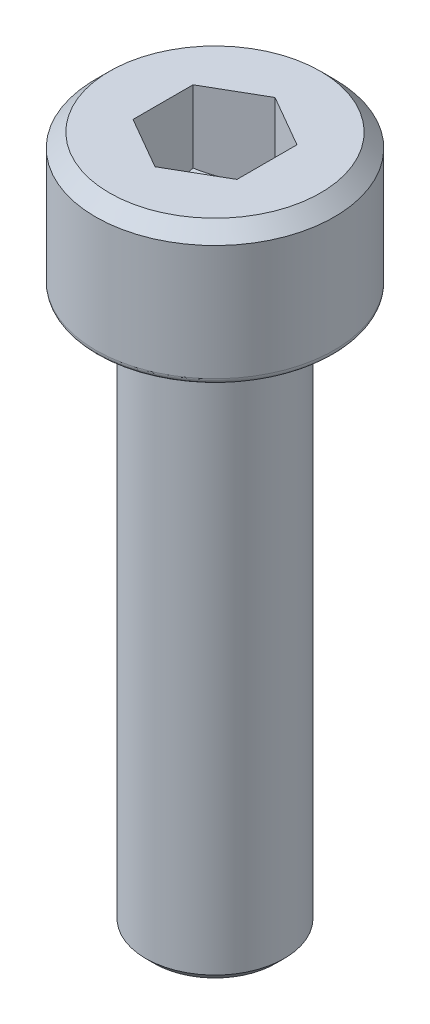
ISO-10303-21;
HEADER;
FILE_DESCRIPTION(('STEP AP214'),'2;1');
FILE_NAME('part.step','',(''),(''),'','','');
FILE_SCHEMA(('AUTOMOTIVE_DESIGN { 1 0 10303 214 1 1 1 1 }'));
ENDSEC;
DATA;
#1=APPLICATION_CONTEXT('core data for automotive mechanical design processes');
#2=APPLICATION_PROTOCOL_DEFINITION('international standard','automotive_design',2000,#1);
#3=PRODUCT_CONTEXT('',#1,'mechanical');
#4=PRODUCT('Part','Part','',(#3));
#5=PRODUCT_RELATED_PRODUCT_CATEGORY('part','',(#4));
#6=PRODUCT_DEFINITION_FORMATION('','',#4);
#7=PRODUCT_DEFINITION_CONTEXT('part definition',#1,'design');
#8=PRODUCT_DEFINITION('design','',#6,#7);
#9=PRODUCT_DEFINITION_SHAPE('','',#8);
#10=(LENGTH_UNIT() NAMED_UNIT(*) SI_UNIT(.MILLI.,.METRE.));
#11=(NAMED_UNIT(*) PLANE_ANGLE_UNIT() SI_UNIT($,.RADIAN.));
#12=(NAMED_UNIT(*) SI_UNIT($,.STERADIAN.) SOLID_ANGLE_UNIT());
#13=UNCERTAINTY_MEASURE_WITH_UNIT(LENGTH_MEASURE(1.E-05),#10,'distance_accuracy_value','');
#14=(GEOMETRIC_REPRESENTATION_CONTEXT(3) GLOBAL_UNCERTAINTY_ASSIGNED_CONTEXT((#13)) GLOBAL_UNIT_ASSIGNED_CONTEXT((#10,
#11,#12)) REPRESENTATION_CONTEXT('',''));
#15=CARTESIAN_POINT('',(0.,0.,0.));
#16=DIRECTION('',(0.,0.,1.));
#17=DIRECTION('',(1.,0.,0.));
#18=AXIS2_PLACEMENT_3D('',#15,#16,#17);
#19=CARTESIAN_POINT('',(-1.76,-16.,1.76));
#20=DIRECTION('',(0.,-1.,0.));
#21=DIRECTION('',(0.,0.,-1.));
#22=AXIS2_PLACEMENT_3D('',#19,#20,#21);
#23=PLANE('',#22);
#24=CARTESIAN_POINT('',(0.,-16.,0.));
#25=DIRECTION('',(0.,1.,0.));
#26=DIRECTION('',(0.,0.,1.));
#27=AXIS2_PLACEMENT_3D('',#24,#25,#26);
#28=CIRCLE('',#27,1.75000000000003);
#29=CARTESIAN_POINT('',(0.,-16.,1.75000000000003));
#30=VERTEX_POINT('',#29);
#31=EDGE_CURVE('E159',#30,#30,#28,.T.);
#32=ORIENTED_EDGE('',*,*,#31,.F.);
#33=EDGE_LOOP('',(#32));
#34=FACE_BOUND('',#33,.T.);
#35=ADVANCED_FACE('F16',(#34),#23,.T.);
#36=CARTESIAN_POINT('',(0.,-16.,0.));
#37=DIRECTION('',(0.,1.,0.));
#38=DIRECTION('',(0.,0.,1.));
#39=AXIS2_PLACEMENT_3D('',#36,#37,#38);
#40=CONICAL_SURFACE('',#39,1.75,0.78539816339741);
#41=CARTESIAN_POINT('',(0.,-15.75,0.));
#42=DIRECTION('',(0.,1.,0.));
#43=DIRECTION('',(0.,0.,1.));
#44=AXIS2_PLACEMENT_3D('',#41,#42,#43);
#45=CIRCLE('',#44,2.);
#46=CARTESIAN_POINT('',(0.,-15.75,2.));
#47=VERTEX_POINT('',#46);
#48=EDGE_CURVE('E155',#47,#47,#45,.T.);
#49=ORIENTED_EDGE('',*,*,#48,.F.);
#50=EDGE_LOOP('',(#49));
#51=FACE_BOUND('',#50,.T.);
#52=ORIENTED_EDGE('',*,*,#31,.T.);
#53=EDGE_LOOP('',(#52));
#54=FACE_BOUND('',#53,.T.);
#55=ADVANCED_FACE('F242',(#51,#54),#40,.T.);
#56=CARTESIAN_POINT('',(0.,-15.75,0.));
#57=DIRECTION('',(0.,1.,0.));
#58=DIRECTION('',(0.,0.,1.));
#59=AXIS2_PLACEMENT_3D('',#56,#57,#58);
#60=CYLINDRICAL_SURFACE('',#59,2.);
#61=CARTESIAN_POINT('',(0.,-0.600000000000001,0.));
#62=DIRECTION('',(0.,1.,0.));
#63=DIRECTION('',(0.,0.,1.));
#64=AXIS2_PLACEMENT_3D('',#61,#62,#63);
#65=CIRCLE('',#64,2.);
#66=CARTESIAN_POINT('',(0.,-0.600000000000001,2.));
#67=VERTEX_POINT('',#66);
#68=EDGE_CURVE('E158',#67,#67,#65,.T.);
#69=ORIENTED_EDGE('',*,*,#68,.F.);
#70=EDGE_LOOP('',(#69));
#71=FACE_BOUND('',#70,.T.);
#72=ORIENTED_EDGE('',*,*,#48,.T.);
#73=EDGE_LOOP('',(#72));
#74=FACE_BOUND('',#73,.T.);
#75=ADVANCED_FACE('F239',(#71,#74),#60,.T.);
#76=CARTESIAN_POINT('',(0.,-0.600000000000001,0.));
#77=DIRECTION('',(0.,-1.,0.));
#78=DIRECTION('',(0.,0.,-1.));
#79=AXIS2_PLACEMENT_3D('',#76,#77,#78);
#80=TOROIDAL_SURFACE('',#79,2.19999999999999,0.199999999999992);
#81=ORIENTED_EDGE('',*,*,#68,.T.);
#82=EDGE_LOOP('',(#81));
#83=FACE_BOUND('',#82,.T.);
#84=CARTESIAN_POINT('',(0.,-0.529775311682322,0.));
#85=DIRECTION('',(0.,1.,0.));
#86=DIRECTION('',(0.,0.,1.));
#87=AXIS2_PLACEMENT_3D('',#84,#85,#86);
#88=CIRCLE('',#87,2.0127341644862);
#89=CARTESIAN_POINT('',(0.,-0.529775311682322,2.0127341644862));
#90=VERTEX_POINT('',#89);
#91=EDGE_CURVE('E227',#90,#90,#88,.T.);
#92=ORIENTED_EDGE('',*,*,#91,.F.);
#93=EDGE_LOOP('',(#92));
#94=FACE_BOUND('',#93,.T.);
#95=ADVANCED_FACE('F236',(#83,#94),#80,.F.);
#96=CARTESIAN_POINT('',(0.,-0.529775311682322,0.));
#97=DIRECTION('',(0.,1.,0.));
#98=DIRECTION('',(0.,0.,1.));
#99=AXIS2_PLACEMENT_3D('',#96,#97,#98);
#100=CONICAL_SURFACE('',#99,2.0127341644862,0.358770670270564);
#101=CARTESIAN_POINT('',(0.,-0.129775311682323,0.));
#102=DIRECTION('',(0.,1.,0.));
#103=DIRECTION('',(0.,0.,1.));
#104=AXIS2_PLACEMENT_3D('',#101,#102,#103);
#105=CIRCLE('',#104,2.16273416448619);
#106=CARTESIAN_POINT('',(0.,-0.129775311682323,2.16273416448619));
#107=VERTEX_POINT('',#106);
#108=EDGE_CURVE('E218',#107,#107,#105,.T.);
#109=ORIENTED_EDGE('',*,*,#108,.F.);
#110=EDGE_LOOP('',(#109));
#111=FACE_BOUND('',#110,.T.);
#112=ORIENTED_EDGE('',*,*,#91,.T.);
#113=EDGE_LOOP('',(#112));
#114=FACE_BOUND('',#113,.T.);
#115=ADVANCED_FACE('F258',(#111,#114),#100,.T.);
#116=CARTESIAN_POINT('',(0.,-0.200000000000004,0.));
#117=DIRECTION('',(0.,-1.,0.));
#118=DIRECTION('',(0.,0.,-1.));
#119=AXIS2_PLACEMENT_3D('',#116,#117,#118);
#120=TOROIDAL_SURFACE('',#119,2.35,0.200000000000003);
#121=ORIENTED_EDGE('',*,*,#108,.T.);
#122=EDGE_LOOP('',(#121));
#123=FACE_BOUND('',#122,.T.);
#124=CARTESIAN_POINT('',(0.,0.,0.));
#125=DIRECTION('',(0.,-1.,0.));
#126=DIRECTION('',(0.,0.,-1.));
#127=AXIS2_PLACEMENT_3D('',#124,#125,#126);
#128=CIRCLE('',#127,2.35);
#129=CARTESIAN_POINT('',(0.,0.,-2.35));
#130=VERTEX_POINT('',#129);
#131=EDGE_CURVE('E215',#130,#130,#128,.F.);
#132=ORIENTED_EDGE('',*,*,#131,.F.);
#133=EDGE_LOOP('',(#132));
#134=FACE_BOUND('',#133,.T.);
#135=ADVANCED_FACE('F261',(#123,#134),#120,.F.);
#136=CARTESIAN_POINT('',(-3.27500000000001,0.,3.27500000000001));
#137=DIRECTION('',(0.,-1.,0.));
#138=DIRECTION('',(0.,0.,-1.));
#139=AXIS2_PLACEMENT_3D('',#136,#137,#138);
#140=PLANE('',#139);
#141=ORIENTED_EDGE('',*,*,#131,.T.);
#142=EDGE_LOOP('',(#141));
#143=FACE_BOUND('',#142,.T.);
#144=CARTESIAN_POINT('',(0.,0.,0.));
#145=DIRECTION('',(0.,-1.,0.));
#146=DIRECTION('',(0.,0.,-1.));
#147=AXIS2_PLACEMENT_3D('',#144,#145,#146);
#148=CIRCLE('',#147,3.26500000000209);
#149=CARTESIAN_POINT('',(0.,0.,-3.26500000000209));
#150=VERTEX_POINT('',#149);
#151=EDGE_CURVE('E212',#150,#150,#148,.F.);
#152=ORIENTED_EDGE('',*,*,#151,.F.);
#153=EDGE_LOOP('',(#152));
#154=FACE_BOUND('',#153,.T.);
#155=ADVANCED_FACE('F265',(#143,#154),#140,.T.);
#156=CARTESIAN_POINT('',(0.,0.18,0.));
#157=DIRECTION('',(0.,-1.,0.));
#158=DIRECTION('',(0.,0.,-1.));
#159=AXIS2_PLACEMENT_3D('',#156,#157,#158);
#160=TOROIDAL_SURFACE('',#159,3.265,0.179999999999994);
#161=CARTESIAN_POINT('',(0.,0.18,0.));
#162=DIRECTION('',(0.,1.,0.));
#163=DIRECTION('',(0.,0.,1.));
#164=AXIS2_PLACEMENT_3D('',#161,#162,#163);
#165=CIRCLE('',#164,3.44500000000004);
#166=CARTESIAN_POINT('',(0.,0.18,3.44500000000006));
#167=VERTEX_POINT('',#166);
#168=EDGE_CURVE('E152',#167,#167,#165,.T.);
#169=ORIENTED_EDGE('',*,*,#168,.F.);
#170=EDGE_LOOP('',(#169));
#171=FACE_BOUND('',#170,.T.);
#172=ORIENTED_EDGE('',*,*,#151,.T.);
#173=EDGE_LOOP('',(#172));
#174=FACE_BOUND('',#173,.T.);
#175=ADVANCED_FACE('F269',(#171,#174),#160,.T.);
#176=CARTESIAN_POINT('',(0.,0.18,0.));
#177=DIRECTION('',(0.,1.,0.));
#178=DIRECTION('',(0.,0.,1.));
#179=AXIS2_PLACEMENT_3D('',#176,#177,#178);
#180=CYLINDRICAL_SURFACE('',#179,3.44500000000004);
#181=CARTESIAN_POINT('',(0.,3.51000000000001,0.));
#182=DIRECTION('',(0.,1.,0.));
#183=DIRECTION('',(0.,0.,1.));
#184=AXIS2_PLACEMENT_3D('',#181,#182,#183);
#185=CIRCLE('',#184,3.44500000000004);
#186=CARTESIAN_POINT('',(0.,3.51000000000001,3.44500000000006));
#187=VERTEX_POINT('',#186);
#188=EDGE_CURVE('E130',#187,#187,#185,.T.);
#189=ORIENTED_EDGE('',*,*,#188,.F.);
#190=EDGE_LOOP('',(#189));
#191=FACE_BOUND('',#190,.T.);
#192=ORIENTED_EDGE('',*,*,#168,.T.);
#193=EDGE_LOOP('',(#192));
#194=FACE_BOUND('',#193,.T.);
#195=ADVANCED_FACE('F272',(#191,#194),#180,.T.);
#196=CARTESIAN_POINT('',(1.50866025403785,3.91999999999999,-0.861025403784438));
#197=DIRECTION('',(-0.499999999999999,0.,0.866025403784439));
#198=DIRECTION('',(-0.866025403784439,0.,-0.499999999999999));
#199=AXIS2_PLACEMENT_3D('',#196,#197,#198);
#200=PLANE('',#199);
#201=DIRECTION('',(-0.866025403784439,0.,-0.499999999999999));
#202=VECTOR('',#201,1.);
#203=CARTESIAN_POINT('',(0.750000000000001,3.91000000000001,-1.29903810567666));
#204=LINE('',#203,#202);
#205=CARTESIAN_POINT('',(1.5,3.91000000000001,-0.866025403784438));
#206=VERTEX_POINT('',#205);
#207=CARTESIAN_POINT('',(0.,3.91000000000001,-1.73205080756888));
#208=VERTEX_POINT('',#207);
#209=EDGE_CURVE('E145',#206,#208,#204,.T.);
#210=ORIENTED_EDGE('',*,*,#209,.T.);
#211=DIRECTION('',(0.,1.,0.));
#212=VECTOR('',#211,1.);
#213=CARTESIAN_POINT('',(0.,2.74373412263473,-1.73205080756888));
#214=LINE('',#213,#212);
#215=CARTESIAN_POINT('',(0.,1.82746824526945,-1.73205080756888));
#216=VERTEX_POINT('',#215);
#217=EDGE_CURVE('E142',#216,#208,#214,.T.);
#218=ORIENTED_EDGE('',*,*,#217,.F.);
#219=CARTESIAN_POINT('',(1.5,1.82746824526945,-0.866025403784438));
#220=CARTESIAN_POINT('',(1.43408408432772,1.80548990411444,-0.904081975441711));
#221=CARTESIAN_POINT('',(1.36759918340909,1.78550175309461,-0.942467050884126));
#222=CARTESIAN_POINT('',(1.23347823998543,1.75061303581965,-1.01990181367375));
#223=CARTESIAN_POINT('',(1.16583981518653,1.73572481052302,-1.05895287643895));
#224=CARTESIAN_POINT('',(1.03140117468084,1.71255021447901,-1.1365710617244));
#225=CARTESIAN_POINT('',(0.964621638287679,1.70410958596712,-1.17512624503735));
#226=CARTESIAN_POINT('',(0.830748509653507,1.69403512136728,-1.25241793189154));
#227=CARTESIAN_POINT('',(0.763655403671039,1.69239294075009,-1.29115415469129));
#228=CARTESIAN_POINT('',(0.638299132717708,1.69581796288553,-1.3635286314708));
#229=CARTESIAN_POINT('',(0.580017157017138,1.70004420918163,-1.39717774583043));
#230=CARTESIAN_POINT('',(0.46383289367647,1.71343622080806,-1.46425676154576));
#231=CARTESIAN_POINT('',(0.405931007586778,1.72260655634594,-1.49768643106623));
#232=CARTESIAN_POINT('',(0.289507393706602,1.7455306202732,-1.56490363587998));
#233=CARTESIAN_POINT('',(0.231000393462343,1.75938147693318,-1.59868266822048));
#234=CARTESIAN_POINT('',(0.114858772496332,1.79081706589896,-1.66573706434933));
#235=CARTESIAN_POINT('',(0.0572226650139546,1.80839441683361,-1.69901328651932));
#236=CARTESIAN_POINT('',(0.,1.82746824526945,-1.73205080756888));
#237=B_SPLINE_CURVE_WITH_KNOTS('',3,(#219,#220,#221,#222,#223,#224,#225,#226,#227,#228,#229,
#230,#231,#232,#233,#234,#235,#236),.UNSPECIFIED.,.F.,.F.,(4,2,2,2,2,2,2,2,4),(0.,
0.237762008667641,0.476095362770333,0.708530704614693,0.940680666673367,1.14278083697392,
1.34506814534581,1.5518412168665,1.75820848013622),.UNSPECIFIED.);
#238=CARTESIAN_POINT('',(1.5,1.82746824526945,-0.866025403784438));
#239=VERTEX_POINT('',#238);
#240=EDGE_CURVE('E188',#239,#216,#237,.T.);
#241=ORIENTED_EDGE('',*,*,#240,.F.);
#242=DIRECTION('',(0.,-1.,0.));
#243=VECTOR('',#242,1.);
#244=CARTESIAN_POINT('',(1.5,2.74373412263473,-0.866025403784438));
#245=LINE('',#244,#243);
#246=EDGE_CURVE('E71',#206,#239,#245,.T.);
#247=ORIENTED_EDGE('',*,*,#246,.F.);
#248=EDGE_LOOP('',(#210,#218,#241,#247));
#249=FACE_BOUND('',#248,.T.);
#250=ADVANCED_FACE('F199',(#249),#200,.T.);
#251=CARTESIAN_POINT('',(0.00866025403784415,3.91999999999999,-1.73705080756888));
#252=DIRECTION('',(0.5,0.,0.866025403784439));
#253=DIRECTION('',(-0.866025403784439,0.,0.5));
#254=AXIS2_PLACEMENT_3D('',#251,#252,#253);
#255=PLANE('',#254);
#256=DIRECTION('',(-0.866025403784439,0.,0.5));
#257=VECTOR('',#256,1.);
#258=CARTESIAN_POINT('',(-0.75,3.91000000000001,-1.29903810567666));
#259=LINE('',#258,#257);
#260=CARTESIAN_POINT('',(-1.5,3.91000000000001,-0.866025403784438));
#261=VERTEX_POINT('',#260);
#262=EDGE_CURVE('E139',#208,#261,#259,.T.);
#263=ORIENTED_EDGE('',*,*,#262,.T.);
#264=DIRECTION('',(0.,1.,0.));
#265=VECTOR('',#264,1.);
#266=CARTESIAN_POINT('',(-1.5,2.74373412263473,-0.866025403784438));
#267=LINE('',#266,#265);
#268=CARTESIAN_POINT('',(-1.5,1.82746824526945,-0.866025403784438));
#269=VERTEX_POINT('',#268);
#270=EDGE_CURVE('E121',#269,#261,#267,.T.);
#271=ORIENTED_EDGE('',*,*,#270,.F.);
#272=CARTESIAN_POINT('',(0.,1.82746824526945,-1.73205080756888));
#273=CARTESIAN_POINT('',(-0.0659159156722816,1.80548990411444,-1.6939942359116));
#274=CARTESIAN_POINT('',(-0.132400816590909,1.78550175309461,-1.65560916046919));
#275=CARTESIAN_POINT('',(-0.266521760014575,1.75061303581964,-1.57817439767957));
#276=CARTESIAN_POINT('',(-0.334160184813476,1.73572481052301,-1.53912333491436));
#277=CARTESIAN_POINT('',(-0.468598825319162,1.71255021447901,-1.46150514962892));
#278=CARTESIAN_POINT('',(-0.535378361712323,1.70410958596712,-1.42294996631597));
#279=CARTESIAN_POINT('',(-0.669251490346494,1.69403512136728,-1.34565827946177));
#280=CARTESIAN_POINT('',(-0.736344596328962,1.69239294075009,-1.30692205666202));
#281=CARTESIAN_POINT('',(-0.861700867282293,1.69581796288553,-1.23454757988251));
#282=CARTESIAN_POINT('',(-0.919982842982862,1.70004420918163,-1.20089846552288));
#283=CARTESIAN_POINT('',(-1.03616710632353,1.71343622080806,-1.13381944980755));
#284=CARTESIAN_POINT('',(-1.09406899241322,1.72260655634594,-1.10038978028708));
#285=CARTESIAN_POINT('',(-1.2104926062934,1.7455306202732,-1.03317257547333));
#286=CARTESIAN_POINT('',(-1.26899960653766,1.75938147693318,-0.999393543132831));
#287=CARTESIAN_POINT('',(-1.38514122750367,1.79081706589896,-0.932339147003986));
#288=CARTESIAN_POINT('',(-1.44277733498605,1.80839441683361,-0.899062924833993));
#289=CARTESIAN_POINT('',(-1.5,1.82746824526945,-0.866025403784438));
#290=B_SPLINE_CURVE_WITH_KNOTS('',3,(#272,#273,#274,#275,#276,#277,#278,#279,#280,#281,#282,
#283,#284,#285,#286,#287,#288,#289),.UNSPECIFIED.,.F.,.F.,(4,2,2,2,2,2,2,2,4),(0.,
0.237762008667641,0.476095362770333,0.708530704614692,0.940680666673366,1.14278083697392,
1.34506814534581,1.5518412168665,1.75820848013622),.UNSPECIFIED.);
#291=EDGE_CURVE('E125',#216,#269,#290,.T.);
#292=ORIENTED_EDGE('',*,*,#291,.F.);
#293=ORIENTED_EDGE('',*,*,#217,.T.);
#294=EDGE_LOOP('',(#263,#271,#292,#293));
#295=FACE_BOUND('',#294,.T.);
#296=ADVANCED_FACE('F195',(#295),#255,.T.);
#297=CARTESIAN_POINT('',(0.,3.51000000000001,0.));
#298=DIRECTION('',(0.,-1.,0.));
#299=DIRECTION('',(0.,0.,-1.));
#300=AXIS2_PLACEMENT_3D('',#297,#298,#299);
#301=CONICAL_SURFACE('',#300,3.44500000000004,0.785398163397446);
#302=CARTESIAN_POINT('',(0.,3.91000000000001,0.));
#303=DIRECTION('',(0.,-1.,0.));
#304=DIRECTION('',(0.,0.,-1.));
#305=AXIS2_PLACEMENT_3D('',#302,#303,#304);
#306=CIRCLE('',#305,3.04500000000004);
#307=CARTESIAN_POINT('',(0.,3.91000000000001,-3.04500000000001));
#308=VERTEX_POINT('',#307);
#309=EDGE_CURVE('E134',#308,#308,#306,.F.);
#310=ORIENTED_EDGE('',*,*,#309,.F.);
#311=EDGE_LOOP('',(#310));
#312=FACE_BOUND('',#311,.T.);
#313=ORIENTED_EDGE('',*,*,#188,.T.);
#314=EDGE_LOOP('',(#313));
#315=FACE_BOUND('',#314,.T.);
#316=ADVANCED_FACE('F89',(#312,#315),#301,.T.);
#317=CARTESIAN_POINT('',(1.5,3.91999999999999,0.876025403784442));
#318=DIRECTION('',(-1.,0.,0.));
#319=DIRECTION('',(0.,0.,-1.));
#320=AXIS2_PLACEMENT_3D('',#317,#318,#319);
#321=PLANE('',#320);
#322=DIRECTION('',(0.,0.,1.));
#323=VECTOR('',#322,1.);
#324=CARTESIAN_POINT('',(1.5,3.91000000000001,0.));
#325=LINE('',#324,#323);
#326=CARTESIAN_POINT('',(1.5,3.91000000000001,0.866025403784441));
#327=VERTEX_POINT('',#326);
#328=EDGE_CURVE('E118',#206,#327,#325,.T.);
#329=ORIENTED_EDGE('',*,*,#328,.F.);
#330=ORIENTED_EDGE('',*,*,#246,.T.);
#331=CARTESIAN_POINT('',(1.5,1.82746824526945,0.866025403784441));
#332=CARTESIAN_POINT('',(1.5,1.80548990411444,0.789912260469896));
#333=CARTESIAN_POINT('',(1.5,1.78550175309461,0.713142109585065));
#334=CARTESIAN_POINT('',(1.5,1.75061303581965,0.558272584005825));
#335=CARTESIAN_POINT('',(1.5,1.73572481052302,0.48017045847541));
#336=CARTESIAN_POINT('',(1.5,1.71255021447901,0.324934087904519));
#337=CARTESIAN_POINT('',(1.5,1.70410958596712,0.24782372127862));
#338=CARTESIAN_POINT('',(1.5,1.69403512136728,0.0932403475702269));
#339=CARTESIAN_POINT('',(1.5,1.69239294075009,0.0157679019707353));
#340=CARTESIAN_POINT('',(1.5,1.69581796288553,-0.128981051588291));
#341=CARTESIAN_POINT('',(1.5,1.70004420918163,-0.196279280307546));
#342=CARTESIAN_POINT('',(1.5,1.71343622080806,-0.330437311738212));
#343=CARTESIAN_POINT('',(1.5,1.72260655634594,-0.397296650779154));
#344=CARTESIAN_POINT('',(1.5,1.7455306202732,-0.53173106040665));
#345=CARTESIAN_POINT('',(1.5,1.75938147693318,-0.599289125087651));
#346=CARTESIAN_POINT('',(1.5,1.79081706589896,-0.733397917345343));
#347=CARTESIAN_POINT('',(1.5,1.80839441683361,-0.799950361685329));
#348=CARTESIAN_POINT('',(1.5,1.82746824526945,-0.866025403784439));
#349=B_SPLINE_CURVE_WITH_KNOTS('',3,(#331,#332,#333,#334,#335,#336,#337,#338,#339,#340,#341,
#342,#343,#344,#345,#346,#347,#348),.UNSPECIFIED.,.F.,.F.,(4,2,2,2,2,2,2,2,4),(0.,
0.237762008667641,0.476095362770333,0.708530704614693,0.940680666673367,1.14278083697392,
1.34506814534581,1.5518412168665,1.75820848013622),.UNSPECIFIED.);
#350=CARTESIAN_POINT('',(1.5,1.82746824526945,0.86602540378444));
#351=VERTEX_POINT('',#350);
#352=EDGE_CURVE('E129',#351,#239,#349,.T.);
#353=ORIENTED_EDGE('',*,*,#352,.F.);
#354=DIRECTION('',(0.,-1.,0.));
#355=VECTOR('',#354,1.);
#356=CARTESIAN_POINT('',(1.5,2.74373412263473,0.866025403784441));
#357=LINE('',#356,#355);
#358=EDGE_CURVE('E165',#327,#351,#357,.T.);
#359=ORIENTED_EDGE('',*,*,#358,.F.);
#360=EDGE_LOOP('',(#329,#330,#353,#359));
#361=FACE_BOUND('',#360,.T.);
#362=ADVANCED_FACE('F78',(#361),#321,.T.);
#363=CARTESIAN_POINT('',(0.,1.82746824526945,0.));
#364=DIRECTION('',(0.,1.,0.));
#365=DIRECTION('',(0.,0.,1.));
#366=AXIS2_PLACEMENT_3D('',#363,#364,#365);
#367=CONICAL_SURFACE('',#366,1.73205080756888,1.0471975511966);
#368=ORIENTED_EDGE('',*,*,#291,.T.);
#369=CARTESIAN_POINT('',(-1.5,1.82746824526945,0.866025403784439));
#370=CARTESIAN_POINT('',(-1.5,1.80694357492337,0.794933305624349));
#371=CARTESIAN_POINT('',(-1.5,1.78815266020556,0.723278805855193));
#372=CARTESIAN_POINT('',(-1.5,1.75494205000568,0.578805828585426));
#373=CARTESIAN_POINT('',(-1.5,1.74053213485961,0.505985123307448));
#374=CARTESIAN_POINT('',(-1.5,1.71735924678032,0.361160826212998));
#375=CARTESIAN_POINT('',(-1.5,1.70847272570834,0.28917762450214));
#376=CARTESIAN_POINT('',(-1.5,1.69654309825454,0.144795924098319));
#377=CARTESIAN_POINT('',(-1.5,1.69349364905317,0.0723979620362948));
#378=CARTESIAN_POINT('',(-1.5,1.6934936490546,-0.0723979620835107));
#379=CARTESIAN_POINT('',(-1.5,1.69654309825704,-0.144795924141291));
#380=CARTESIAN_POINT('',(-1.5,1.70847272571224,-0.289177624536593));
#381=CARTESIAN_POINT('',(-1.5,1.71735924678451,-0.361160826243176));
#382=CARTESIAN_POINT('',(-1.5,1.7405321348637,-0.50598512332895));
#383=CARTESIAN_POINT('',(-1.5,1.75494205000934,-0.57880582860253));
#384=CARTESIAN_POINT('',(-1.5,1.78815266020777,-0.723278805863639));
#385=CARTESIAN_POINT('',(-1.5,1.80694357492458,-0.794933305628535));
#386=CARTESIAN_POINT('',(-1.5,1.82746824526945,-0.866025403784439));
#387=B_SPLINE_CURVE_WITH_KNOTS('',3,(#369,#370,#371,#372,#373,#374,#375,#376,#377,#378,#379,
#380,#381,#382,#383,#384,#385,#386),.UNSPECIFIED.,.F.,.F.,(4,2,2,2,2,2,2,2,4),(0.,
0.222055046944474,0.444602239579074,0.661973144396534,0.879107710018951,1.09624227562884,
1.31361318043372,1.53616037305516,1.75821541998654),.UNSPECIFIED.);
#388=CARTESIAN_POINT('',(-1.5,1.82746824526945,0.866025403784439));
#389=VERTEX_POINT('',#388);
#390=EDGE_CURVE('E124',#389,#269,#387,.T.);
#391=ORIENTED_EDGE('',*,*,#390,.F.);
#392=CARTESIAN_POINT('',(0.,1.82746824526945,1.73205080756888));
#393=CARTESIAN_POINT('',(-0.0659159156722827,1.80548990411444,1.69399423591161));
#394=CARTESIAN_POINT('',(-0.13240081659091,1.78550175309461,1.65560916046919));
#395=CARTESIAN_POINT('',(-0.266521760014576,1.75061303581965,1.57817439767957));
#396=CARTESIAN_POINT('',(-0.334160184813477,1.73572481052302,1.53912333491436));
#397=CARTESIAN_POINT('',(-0.468598825319163,1.71255021447901,1.46150514962892));
#398=CARTESIAN_POINT('',(-0.535378361712324,1.70410958596712,1.42294996631597));
#399=CARTESIAN_POINT('',(-0.669251490346495,1.69403512136728,1.34565827946177));
#400=CARTESIAN_POINT('',(-0.736344596328963,1.69239294075009,1.30692205666203));
#401=CARTESIAN_POINT('',(-0.861700867282294,1.69581796288553,1.23454757988251));
#402=CARTESIAN_POINT('',(-0.919982842982863,1.70004420918163,1.20089846552288));
#403=CARTESIAN_POINT('',(-1.03616710632353,1.71343622080806,1.13381944980755));
#404=CARTESIAN_POINT('',(-1.09406899241322,1.72260655634594,1.10038978028708));
#405=CARTESIAN_POINT('',(-1.2104926062934,1.7455306202732,1.03317257547333));
#406=CARTESIAN_POINT('',(-1.26899960653766,1.75938147693318,0.999393543132832));
#407=CARTESIAN_POINT('',(-1.38514122750367,1.79081706589896,0.932339147003986));
#408=CARTESIAN_POINT('',(-1.44277733498605,1.80839441683361,0.899062924833993));
#409=CARTESIAN_POINT('',(-1.5,1.82746824526945,0.866025403784438));
#410=B_SPLINE_CURVE_WITH_KNOTS('',3,(#392,#393,#394,#395,#396,#397,#398,#399,#400,#401,#402,
#403,#404,#405,#406,#407,#408,#409),.UNSPECIFIED.,.F.,.F.,(4,2,2,2,2,2,2,2,4),(0.,
0.237762008667641,0.476095362770333,0.708530704614693,0.940680666673367,1.14278083697392,
1.34506814534581,1.5518412168665,1.75820848013622),.UNSPECIFIED.);
#411=CARTESIAN_POINT('',(0.,1.82746824526945,1.73205080756888));
#412=VERTEX_POINT('',#411);
#413=EDGE_CURVE('E107',#412,#389,#410,.T.);
#414=ORIENTED_EDGE('',*,*,#413,.F.);
#415=CARTESIAN_POINT('',(1.5,1.82746824526945,0.866025403784439));
#416=CARTESIAN_POINT('',(1.43408408432772,1.80548990411444,0.904081975441711));
#417=CARTESIAN_POINT('',(1.36759918340909,1.78550175309461,0.942467050884126));
#418=CARTESIAN_POINT('',(1.23347823998542,1.75061303581964,1.01990181367375));
#419=CARTESIAN_POINT('',(1.16583981518652,1.73572481052301,1.05895287643895));
#420=CARTESIAN_POINT('',(1.03140117468084,1.71255021447901,1.1365710617244));
#421=CARTESIAN_POINT('',(0.964621638287677,1.70410958596712,1.17512624503735));
#422=CARTESIAN_POINT('',(0.830748509653505,1.69403512136728,1.25241793189155));
#423=CARTESIAN_POINT('',(0.763655403671037,1.69239294075009,1.29115415469129));
#424=CARTESIAN_POINT('',(0.638299132717706,1.69581796288553,1.3635286314708));
#425=CARTESIAN_POINT('',(0.580017157017137,1.70004420918163,1.39717774583043));
#426=CARTESIAN_POINT('',(0.463832893676468,1.71343622080806,1.46425676154576));
#427=CARTESIAN_POINT('',(0.405931007586777,1.72260655634594,1.49768643106624));
#428=CARTESIAN_POINT('',(0.289507393706601,1.7455306202732,1.56490363587998));
#429=CARTESIAN_POINT('',(0.231000393462342,1.75938147693318,1.59868266822048));
#430=CARTESIAN_POINT('',(0.114858772496332,1.79081706589896,1.66573706434933));
#431=CARTESIAN_POINT('',(0.0572226650139537,1.80839441683361,1.69901328651932));
#432=CARTESIAN_POINT('',(0.,1.82746824526945,1.73205080756888));
#433=B_SPLINE_CURVE_WITH_KNOTS('',3,(#415,#416,#417,#418,#419,#420,#421,#422,#423,#424,#425,
#426,#427,#428,#429,#430,#431,#432),.UNSPECIFIED.,.F.,.F.,(4,2,2,2,2,2,2,2,4),(0.,
0.237762008667641,0.476095362770332,0.708530704614692,0.940680666673366,1.14278083697392,
1.34506814534581,1.5518412168665,1.75820848013622),.UNSPECIFIED.);
#434=EDGE_CURVE('E117',#351,#412,#433,.T.);
#435=ORIENTED_EDGE('',*,*,#434,.F.);
#436=ORIENTED_EDGE('',*,*,#352,.T.);
#437=ORIENTED_EDGE('',*,*,#240,.T.);
#438=EDGE_LOOP('',(#368,#391,#414,#435,#436,#437));
#439=FACE_BOUND('',#438,.T.);
#440=CARTESIAN_POINT('',(0.,0.827468245269451,0.));
#441=VERTEX_POINT('',#440);
#442=VERTEX_LOOP('',#441);
#443=FACE_BOUND('',#442,.T.);
#444=ADVANCED_FACE('F75',(#439,#443),#367,.F.);
#445=CARTESIAN_POINT('',(-1.5,3.91999999999999,-0.876025403784439));
#446=DIRECTION('',(1.,0.,0.));
#447=DIRECTION('',(0.,0.,1.));
#448=AXIS2_PLACEMENT_3D('',#445,#446,#447);
#449=PLANE('',#448);
#450=DIRECTION('',(0.,1.,0.));
#451=VECTOR('',#450,1.);
#452=CARTESIAN_POINT('',(-1.5,2.74373412263473,0.866025403784438));
#453=LINE('',#452,#451);
#454=CARTESIAN_POINT('',(-1.5,3.91000000000001,0.866025403784438));
#455=VERTEX_POINT('',#454);
#456=EDGE_CURVE('E104',#389,#455,#453,.T.);
#457=ORIENTED_EDGE('',*,*,#456,.F.);
#458=ORIENTED_EDGE('',*,*,#390,.T.);
#459=ORIENTED_EDGE('',*,*,#270,.T.);
#460=DIRECTION('',(0.,0.,-1.));
#461=VECTOR('',#460,1.);
#462=CARTESIAN_POINT('',(-1.5,3.91000000000001,0.));
#463=LINE('',#462,#461);
#464=EDGE_CURVE('E115',#455,#261,#463,.T.);
#465=ORIENTED_EDGE('',*,*,#464,.F.);
#466=EDGE_LOOP('',(#457,#458,#459,#465));
#467=FACE_BOUND('',#466,.T.);
#468=ADVANCED_FACE('F77',(#467),#449,.T.);
#469=CARTESIAN_POINT('',(-3.055,3.91000000000001,-3.055));
#470=DIRECTION('',(0.,1.,0.));
#471=DIRECTION('',(0.,0.,1.));
#472=AXIS2_PLACEMENT_3D('',#469,#470,#471);
#473=PLANE('',#472);
#474=ORIENTED_EDGE('',*,*,#464,.T.);
#475=ORIENTED_EDGE('',*,*,#262,.F.);
#476=ORIENTED_EDGE('',*,*,#209,.F.);
#477=ORIENTED_EDGE('',*,*,#328,.T.);
#478=DIRECTION('',(0.866025403784439,0.,-0.5));
#479=VECTOR('',#478,1.);
#480=CARTESIAN_POINT('',(0.75,3.91000000000001,1.29903810567666));
#481=LINE('',#480,#479);
#482=CARTESIAN_POINT('',(0.,3.91000000000001,1.73205080756888));
#483=VERTEX_POINT('',#482);
#484=EDGE_CURVE('E36',#483,#327,#481,.T.);
#485=ORIENTED_EDGE('',*,*,#484,.F.);
#486=DIRECTION('',(0.866025403784438,0.,0.500000000000001));
#487=VECTOR('',#486,1.);
#488=CARTESIAN_POINT('',(-0.75,3.91000000000001,1.29903810567666));
#489=LINE('',#488,#487);
#490=EDGE_CURVE('E27',#455,#483,#489,.T.);
#491=ORIENTED_EDGE('',*,*,#490,.F.);
#492=EDGE_LOOP('',(#474,#475,#476,#477,#485,#491));
#493=FACE_BOUND('',#492,.T.);
#494=ORIENTED_EDGE('',*,*,#309,.T.);
#495=EDGE_LOOP('',(#494));
#496=FACE_BOUND('',#495,.T.);
#497=ADVANCED_FACE('F86',(#493,#496),#473,.T.);
#498=CARTESIAN_POINT('',(-0.00866025403784499,3.91999999999999,1.73705080756888));
#499=DIRECTION('',(-0.5,0.,-0.866025403784439));
#500=DIRECTION('',(0.866025403784439,0.,-0.5));
#501=AXIS2_PLACEMENT_3D('',#498,#499,#500);
#502=PLANE('',#501);
#503=ORIENTED_EDGE('',*,*,#484,.T.);
#504=ORIENTED_EDGE('',*,*,#358,.T.);
#505=ORIENTED_EDGE('',*,*,#434,.T.);
#506=DIRECTION('',(0.,-1.,0.));
#507=VECTOR('',#506,1.);
#508=CARTESIAN_POINT('',(0.,2.74373412263473,1.73205080756888));
#509=LINE('',#508,#507);
#510=EDGE_CURVE('E10',#483,#412,#509,.T.);
#511=ORIENTED_EDGE('',*,*,#510,.F.);
#512=EDGE_LOOP('',(#503,#504,#505,#511));
#513=FACE_BOUND('',#512,.T.);
#514=ADVANCED_FACE('F94',(#513),#502,.T.);
#515=CARTESIAN_POINT('',(-1.50866025403784,3.91999999999999,0.861025403784438));
#516=DIRECTION('',(0.500000000000001,0.,-0.866025403784438));
#517=DIRECTION('',(0.866025403784438,0.,0.500000000000001));
#518=AXIS2_PLACEMENT_3D('',#515,#516,#517);
#519=PLANE('',#518);
#520=ORIENTED_EDGE('',*,*,#490,.T.);
#521=ORIENTED_EDGE('',*,*,#510,.T.);
#522=ORIENTED_EDGE('',*,*,#413,.T.);
#523=ORIENTED_EDGE('',*,*,#456,.T.);
#524=EDGE_LOOP('',(#520,#521,#522,#523));
#525=FACE_BOUND('',#524,.T.);
#526=ADVANCED_FACE('F18',(#525),#519,.T.);
#527=CLOSED_SHELL('',(#35,#55,#75,#95,#115,#135,#155,#175,#195,#250,#296,#316,#362,#444,#468,
#497,#514,#526));
#528=MANIFOLD_SOLID_BREP('B1',#527);
#529=ADVANCED_BREP_SHAPE_REPRESENTATION('',(#18,#528),#14);
#530=SHAPE_DEFINITION_REPRESENTATION(#9,#529);
ENDSEC;
END-ISO-10303-21;
